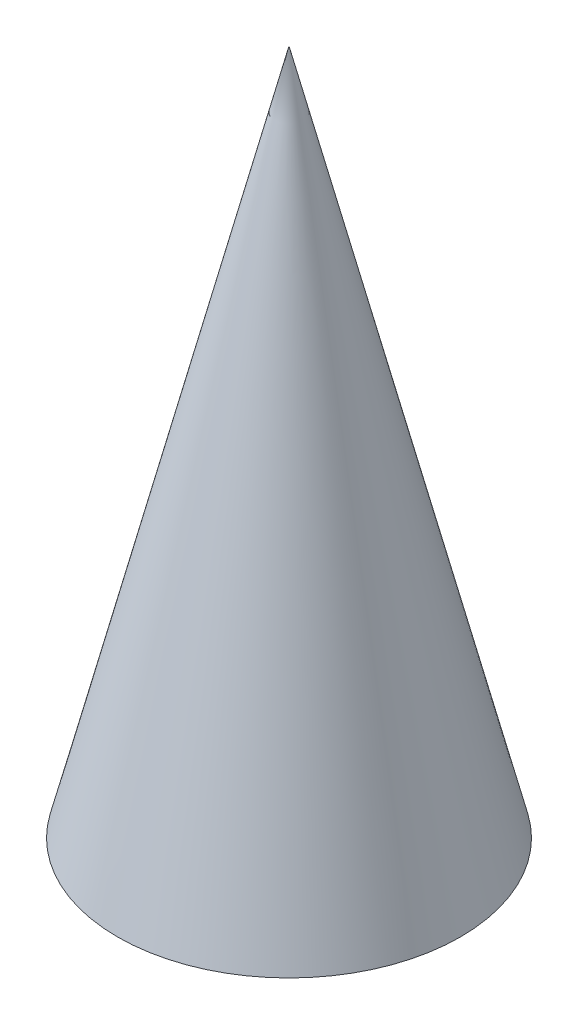
ISO-10303-21;
HEADER;
FILE_DESCRIPTION(('STEP AP214'),'2;1');
FILE_NAME('part.step','',(''),(''),'','','');
FILE_SCHEMA(('AUTOMOTIVE_DESIGN { 1 0 10303 214 1 1 1 1 }'));
ENDSEC;
DATA;
#1=APPLICATION_CONTEXT('core data for automotive mechanical design processes');
#2=APPLICATION_PROTOCOL_DEFINITION('international standard','automotive_design',2000,#1);
#3=PRODUCT_CONTEXT('',#1,'mechanical');
#4=PRODUCT('Part','Part','',(#3));
#5=PRODUCT_RELATED_PRODUCT_CATEGORY('part','',(#4));
#6=PRODUCT_DEFINITION_FORMATION('','',#4);
#7=PRODUCT_DEFINITION_CONTEXT('part definition',#1,'design');
#8=PRODUCT_DEFINITION('design','',#6,#7);
#9=PRODUCT_DEFINITION_SHAPE('','',#8);
#10=(LENGTH_UNIT() NAMED_UNIT(*) SI_UNIT(.MILLI.,.METRE.));
#11=(NAMED_UNIT(*) PLANE_ANGLE_UNIT() SI_UNIT($,.RADIAN.));
#12=(NAMED_UNIT(*) SI_UNIT($,.STERADIAN.) SOLID_ANGLE_UNIT());
#13=UNCERTAINTY_MEASURE_WITH_UNIT(LENGTH_MEASURE(1.E-05),#10,'distance_accuracy_value','');
#14=(GEOMETRIC_REPRESENTATION_CONTEXT(3) GLOBAL_UNCERTAINTY_ASSIGNED_CONTEXT((#13)) GLOBAL_UNIT_ASSIGNED_CONTEXT((#10,
#11,#12)) REPRESENTATION_CONTEXT('',''));
#15=CARTESIAN_POINT('',(0.,0.,0.));
#16=DIRECTION('',(0.,0.,1.));
#17=DIRECTION('',(1.,0.,0.));
#18=AXIS2_PLACEMENT_3D('',#15,#16,#17);
#19=CARTESIAN_POINT('',(0.,0.,0.));
#20=DIRECTION('',(0.,1.,0.));
#21=DIRECTION('',(-1.,0.,0.));
#22=AXIS2_PLACEMENT_3D('',#19,#20,#21);
#23=PLANE('',#22);
#24=CARTESIAN_POINT('',(0.,0.,0.));
#25=DIRECTION('',(0.,1.,0.));
#26=DIRECTION('',(-1.,0.,0.));
#27=AXIS2_PLACEMENT_3D('',#24,#25,#26);
#28=CIRCLE('',#27,10.);
#29=CARTESIAN_POINT('',(-10.,0.,0.));
#30=VERTEX_POINT('',#29);
#31=EDGE_CURVE('E11',#30,#30,#28,.T.);
#32=ORIENTED_EDGE('',*,*,#31,.F.);
#33=EDGE_LOOP('',(#32));
#34=FACE_BOUND('',#33,.T.);
#35=ADVANCED_FACE('F30',(#34),#23,.F.);
#36=CARTESIAN_POINT('',(0.,0.,0.));
#37=DIRECTION('',(0.,-1.,0.));
#38=DIRECTION('',(1.,0.,0.));
#39=AXIS2_PLACEMENT_3D('',#36,#37,#38);
#40=CONICAL_SURFACE('',#39,10.,0.244978663126864);
#41=CARTESIAN_POINT('',(0.,40.,0.));
#42=VERTEX_POINT('',#41);
#43=VERTEX_LOOP('',#42);
#44=FACE_BOUND('',#43,.T.);
#45=ORIENTED_EDGE('',*,*,#31,.T.);
#46=EDGE_LOOP('',(#45));
#47=FACE_BOUND('',#46,.T.);
#48=ADVANCED_FACE('F37',(#44,#47),#40,.T.);
#49=CLOSED_SHELL('',(#35,#48));
#50=MANIFOLD_SOLID_BREP('B2',#49);
#51=ADVANCED_BREP_SHAPE_REPRESENTATION('',(#18,#50),#14);
#52=SHAPE_DEFINITION_REPRESENTATION(#9,#51);
ENDSEC;
END-ISO-10303-21;
